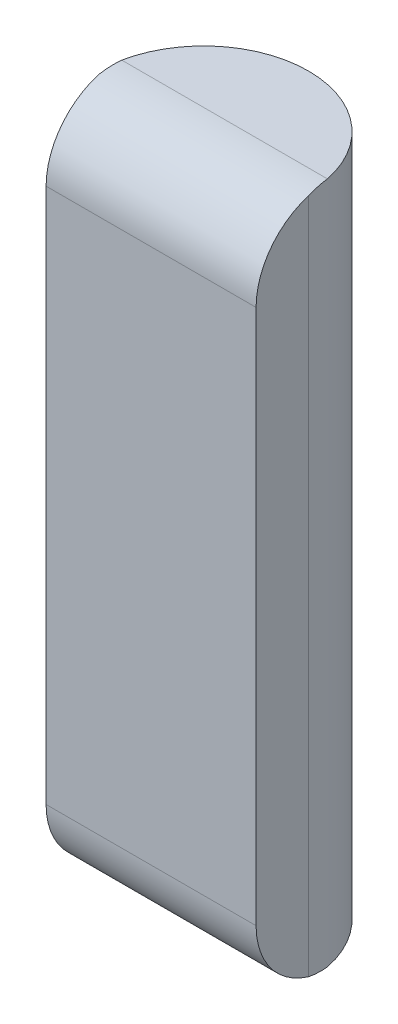
ISO-10303-21;
HEADER;
FILE_DESCRIPTION(('STEP AP214'),'2;1');
FILE_NAME('part.step','',(''),(''),'','','');
FILE_SCHEMA(('AUTOMOTIVE_DESIGN { 1 0 10303 214 1 1 1 1 }'));
ENDSEC;
DATA;
#1=APPLICATION_CONTEXT('core data for automotive mechanical design processes');
#2=APPLICATION_PROTOCOL_DEFINITION('international standard','automotive_design',2000,#1);
#3=PRODUCT_CONTEXT('',#1,'mechanical');
#4=PRODUCT('Part','Part','',(#3));
#5=PRODUCT_RELATED_PRODUCT_CATEGORY('part','',(#4));
#6=PRODUCT_DEFINITION_FORMATION('','',#4);
#7=PRODUCT_DEFINITION_CONTEXT('part definition',#1,'design');
#8=PRODUCT_DEFINITION('design','',#6,#7);
#9=PRODUCT_DEFINITION_SHAPE('','',#8);
#10=(LENGTH_UNIT() NAMED_UNIT(*) SI_UNIT(.MILLI.,.METRE.));
#11=(NAMED_UNIT(*) PLANE_ANGLE_UNIT() SI_UNIT($,.RADIAN.));
#12=(NAMED_UNIT(*) SI_UNIT($,.STERADIAN.) SOLID_ANGLE_UNIT());
#13=UNCERTAINTY_MEASURE_WITH_UNIT(LENGTH_MEASURE(1.E-05),#10,'distance_accuracy_value','');
#14=(GEOMETRIC_REPRESENTATION_CONTEXT(3) GLOBAL_UNCERTAINTY_ASSIGNED_CONTEXT((#13)) GLOBAL_UNIT_ASSIGNED_CONTEXT((#10,
#11,#12)) REPRESENTATION_CONTEXT('',''));
#15=CARTESIAN_POINT('',(0.,0.,0.));
#16=DIRECTION('',(0.,0.,1.));
#17=DIRECTION('',(1.,0.,0.));
#18=AXIS2_PLACEMENT_3D('',#15,#16,#17);
#19=CARTESIAN_POINT('',(-0.2,0.,0.35));
#20=DIRECTION('',(0.,1.,0.));
#21=DIRECTION('',(0.,0.,-1.));
#22=AXIS2_PLACEMENT_3D('',#19,#20,#21);
#23=CYLINDRICAL_SURFACE('',#22,0.1);
#24=CARTESIAN_POINT('',(-0.0999999999999996,0.647082039324995,0.349999999999997));
#25=CARTESIAN_POINT('',(-0.100084183762028,0.647323506050398,0.349190121189793));
#26=CARTESIAN_POINT('',(-0.100168367524056,0.647550292569989,0.348375866058584));
#27=CARTESIAN_POINT('',(-0.100336735048112,0.647974238368766,0.34673967912913));
#28=CARTESIAN_POINT('',(-0.10042091881014,0.648171397647952,0.345917747330885));
#29=CARTESIAN_POINT('',(-0.100589286334196,0.648535822137135,0.344267283042332));
#30=CARTESIAN_POINT('',(-0.100673470096224,0.648703087347132,0.343438750552023));
#31=CARTESIAN_POINT('',(-0.10084183762028,0.649007506544538,0.341776172212152));
#32=CARTESIAN_POINT('',(-0.100926021382308,0.649144660531946,0.340942126362589));
#33=CARTESIAN_POINT('',(-0.101094388906364,0.649388676630988,0.339269615138349));
#34=CARTESIAN_POINT('',(-0.101178572668392,0.649495538742622,0.338431149763672));
#35=CARTESIAN_POINT('',(-0.101346940192448,0.649678831688704,0.336750899341898));
#36=CARTESIAN_POINT('',(-0.101431123954476,0.649755262523153,0.3359091142948));
#37=CARTESIAN_POINT('',(-0.101599491478532,0.649877590349677,0.334223328579187));
#38=CARTESIAN_POINT('',(-0.10168367524056,0.649923487341753,0.333379327910672));
#39=CARTESIAN_POINT('',(-0.101852042764616,0.649984695768093,0.331690218311812));
#40=CARTESIAN_POINT('',(-0.101936226526644,0.650000007202358,0.330845109381467));
#41=CARTESIAN_POINT('',(-0.102020410288672,0.65,0.33));
#42=B_SPLINE_CURVE_WITH_KNOTS('',3,(#24,#25,#26,#27,#28,#29,#30,#31,#32,#33,#34,#35,#36,#37,#38,
#39,#40,#41),.UNSPECIFIED.,.F.,.F.,(4,2,2,2,2,2,2,2,4),(0.,0.00254773712594254,
0.00509547425188514,0.00764321137782773,0.0101909485037703,0.0127386856297129,
0.0152864227556554,0.017834159881598,0.0203818970075406),.UNSPECIFIED.);
#43=CARTESIAN_POINT('',(-0.0999999999999996,0.647082039324994,0.35));
#44=VERTEX_POINT('',#43);
#45=CARTESIAN_POINT('',(-0.102020410288672,0.65,0.33));
#46=VERTEX_POINT('',#45);
#47=EDGE_CURVE('E11',#44,#46,#42,.T.);
#48=ORIENTED_EDGE('',*,*,#47,.F.);
#49=DIRECTION('',(0.,1.,0.));
#50=VECTOR('',#49,1.);
#51=CARTESIAN_POINT('',(-0.0999999999999996,0.,0.35));
#52=LINE('',#51,#50);
#53=CARTESIAN_POINT('',(-0.0999999999999996,0.00291796067500623,0.35));
#54=VERTEX_POINT('',#53);
#55=EDGE_CURVE('E25',#54,#44,#52,.T.);
#56=ORIENTED_EDGE('',*,*,#55,.F.);
#57=CARTESIAN_POINT('',(-0.102020410288672,0.,0.33));
#58=CARTESIAN_POINT('',(-0.101936226526644,-7.20235841984537E-09,0.330845109381467));
#59=CARTESIAN_POINT('',(-0.101852042764616,1.53042319068143E-05,0.331690218311812));
#60=CARTESIAN_POINT('',(-0.10168367524056,7.65126582474996E-05,0.333379327910672));
#61=CARTESIAN_POINT('',(-0.101599491478532,0.000122409650322952,0.334223328579187));
#62=CARTESIAN_POINT('',(-0.101431123954476,0.000244737476846982,0.3359091142948));
#63=CARTESIAN_POINT('',(-0.101346940192448,0.000321168311295557,0.336750899341898));
#64=CARTESIAN_POINT('',(-0.101178572668392,0.00050446125737801,0.338431149763672));
#65=CARTESIAN_POINT('',(-0.101094388906364,0.000611323369011887,0.339269615138349));
#66=CARTESIAN_POINT('',(-0.100926021382308,0.000855339468053773,0.340942126362589));
#67=CARTESIAN_POINT('',(-0.10084183762028,0.000992493455461783,0.341776172212152));
#68=CARTESIAN_POINT('',(-0.100673470096224,0.00129691265286741,0.343438750552023));
#69=CARTESIAN_POINT('',(-0.100589286334196,0.00146417786286502,0.344267283042332));
#70=CARTESIAN_POINT('',(-0.10042091881014,0.00182860235204825,0.345917747330885));
#71=CARTESIAN_POINT('',(-0.100336735048112,0.00202576163123387,0.34673967912913));
#72=CARTESIAN_POINT('',(-0.100168367524056,0.00244970743001086,0.348375866058584));
#73=CARTESIAN_POINT('',(-0.100084183762028,0.00267649394960224,0.349190121189793));
#74=CARTESIAN_POINT('',(-0.0999999999999997,0.00291796067500538,0.349999999999997));
#75=B_SPLINE_CURVE_WITH_KNOTS('',3,(#57,#58,#59,#60,#61,#62,#63,#64,#65,#66,#67,#68,#69,#70,#71,
#72,#73,#74),.UNSPECIFIED.,.F.,.F.,(4,2,2,2,2,2,2,2,4),(0.,0.00254773712594254,
0.00509547425188523,0.00764321137782783,0.0101909485037704,0.012738685629713,0.0152864227556556,
0.0178341598815981,0.0203818970075408),.UNSPECIFIED.);
#76=CARTESIAN_POINT('',(-0.102020410288672,0.,0.33));
#77=VERTEX_POINT('',#76);
#78=EDGE_CURVE('E171',#77,#54,#75,.T.);
#79=ORIENTED_EDGE('',*,*,#78,.F.);
#80=CARTESIAN_POINT('',(-0.2,0.,0.35));
#81=DIRECTION('',(0.,1.,0.));
#82=DIRECTION('',(0.,0.,1.));
#83=AXIS2_PLACEMENT_3D('',#80,#81,#82);
#84=CIRCLE('',#83,0.1);
#85=CARTESIAN_POINT('',(-0.297979589711327,0.,0.33));
#86=VERTEX_POINT('',#85);
#87=EDGE_CURVE('E206',#77,#86,#84,.T.);
#88=ORIENTED_EDGE('',*,*,#87,.T.);
#89=CARTESIAN_POINT('',(-0.3,0.00291796067500535,0.349999999999997));
#90=CARTESIAN_POINT('',(-0.299915816237971,0.0026764939496022,0.349190121189793));
#91=CARTESIAN_POINT('',(-0.299831632475942,0.00244970743001083,0.348375866058584));
#92=CARTESIAN_POINT('',(-0.299663264951883,0.00202576163123386,0.34673967912913));
#93=CARTESIAN_POINT('',(-0.299579081189854,0.00182860235204825,0.345917747330885));
#94=CARTESIAN_POINT('',(-0.299410713665796,0.00146417786286502,0.344267283042332));
#95=CARTESIAN_POINT('',(-0.299326529903767,0.0012969126528674,0.343438750552023));
#96=CARTESIAN_POINT('',(-0.299158162379708,0.00099249345546176,0.341776172212152));
#97=CARTESIAN_POINT('',(-0.299073978617679,0.000855339468053745,0.340942126362589));
#98=CARTESIAN_POINT('',(-0.298905611093621,0.000611323369011869,0.339269615138349));
#99=CARTESIAN_POINT('',(-0.298821427331592,0.000504461257378004,0.338431149763672));
#100=CARTESIAN_POINT('',(-0.298653059807533,0.000321168311295559,0.336750899341898));
#101=CARTESIAN_POINT('',(-0.298568876045504,0.00024473747684698,0.3359091142948));
#102=CARTESIAN_POINT('',(-0.298400508521446,0.000122409650322956,0.334223328579187));
#103=CARTESIAN_POINT('',(-0.298316324759417,7.65126582475103E-05,0.333379327910672));
#104=CARTESIAN_POINT('',(-0.298147957235358,1.53042319068288E-05,0.331690218311812));
#105=CARTESIAN_POINT('',(-0.298063773473329,-7.20235840708838E-09,0.330845109381467));
#106=CARTESIAN_POINT('',(-0.2979795897113,0.,0.33));
#107=B_SPLINE_CURVE_WITH_KNOTS('',3,(#89,#90,#91,#92,#93,#94,#95,#96,#97,#98,#99,#100,#101,#102,
#103,#104,#105,#106),.UNSPECIFIED.,.F.,.F.,(4,2,2,2,2,2,2,2,4),(0.,0.00254773712594293,
0.00509547425188588,0.00764321137782877,0.0101909485037718,0.0127386856297146,
0.0152864227556575,0.0178341598816005,0.0203818970075434),.UNSPECIFIED.);
#108=CARTESIAN_POINT('',(-0.3,0.00291796067500618,0.35));
#109=VERTEX_POINT('',#108);
#110=EDGE_CURVE('E203',#109,#86,#107,.T.);
#111=ORIENTED_EDGE('',*,*,#110,.F.);
#112=DIRECTION('',(0.,1.,0.));
#113=VECTOR('',#112,1.);
#114=CARTESIAN_POINT('',(-0.3,0.,0.35));
#115=LINE('',#114,#113);
#116=CARTESIAN_POINT('',(-0.3,0.647082039324994,0.35));
#117=VERTEX_POINT('',#116);
#118=EDGE_CURVE('E75',#109,#117,#115,.T.);
#119=ORIENTED_EDGE('',*,*,#118,.T.);
#120=CARTESIAN_POINT('',(-0.297979589711327,0.65,0.33));
#121=CARTESIAN_POINT('',(-0.298063773473355,0.650000007202358,0.330845109381467));
#122=CARTESIAN_POINT('',(-0.298147957235383,0.649984695768093,0.331690218311812));
#123=CARTESIAN_POINT('',(-0.298316324759439,0.649923487341753,0.333379327910672));
#124=CARTESIAN_POINT('',(-0.298400508521467,0.649877590349677,0.334223328579187));
#125=CARTESIAN_POINT('',(-0.298568876045523,0.649755262523153,0.3359091142948));
#126=CARTESIAN_POINT('',(-0.298653059807551,0.649678831688704,0.336750899341897));
#127=CARTESIAN_POINT('',(-0.298821427331607,0.649495538742622,0.338431149763672));
#128=CARTESIAN_POINT('',(-0.298905611093635,0.649388676630988,0.339269615138349));
#129=CARTESIAN_POINT('',(-0.299073978617692,0.649144660531946,0.340942126362589));
#130=CARTESIAN_POINT('',(-0.29915816237972,0.649007506544538,0.341776172212152));
#131=CARTESIAN_POINT('',(-0.299326529903776,0.648703087347132,0.343438750552023));
#132=CARTESIAN_POINT('',(-0.299410713665804,0.648535822137135,0.344267283042332));
#133=CARTESIAN_POINT('',(-0.29957908118986,0.648171397647952,0.345917747330885));
#134=CARTESIAN_POINT('',(-0.299663264951888,0.647974238368766,0.34673967912913));
#135=CARTESIAN_POINT('',(-0.299831632475944,0.647550292569989,0.348375866058584));
#136=CARTESIAN_POINT('',(-0.299915816237972,0.647323506050398,0.349190121189793));
#137=CARTESIAN_POINT('',(-0.3,0.647082039324995,0.349999999999997));
#138=B_SPLINE_CURVE_WITH_KNOTS('',3,(#120,#121,#122,#123,#124,#125,#126,#127,#128,#129,#130,
#131,#132,#133,#134,#135,#136,#137),.UNSPECIFIED.,.F.,.F.,(4,2,2,2,2,2,2,2,4),(0.,
0.00254773712594256,0.00509547425188514,0.00764321137782775,0.0101909485037703,
0.0127386856297129,0.0152864227556555,0.0178341598815981,0.0203818970075407),.UNSPECIFIED.);
#139=CARTESIAN_POINT('',(-0.297979589711327,0.65,0.33));
#140=VERTEX_POINT('',#139);
#141=EDGE_CURVE('E125',#140,#117,#138,.T.);
#142=ORIENTED_EDGE('',*,*,#141,.F.);
#143=CARTESIAN_POINT('',(-0.2,0.65,0.35));
#144=DIRECTION('',(0.,1.,0.));
#145=DIRECTION('',(0.,0.,1.));
#146=AXIS2_PLACEMENT_3D('',#143,#144,#145);
#147=CIRCLE('',#146,0.1);
#148=EDGE_CURVE('E120',#46,#140,#147,.T.);
#149=ORIENTED_EDGE('',*,*,#148,.F.);
#150=EDGE_LOOP('',(#48,#56,#79,#88,#111,#119,#142,#149));
#151=FACE_BOUND('',#150,.T.);
#152=ADVANCED_FACE('F17',(#151),#23,.T.);
#153=CARTESIAN_POINT('',(-0.0999999999999996,0.,0.35));
#154=DIRECTION('',(1.,0.,0.));
#155=DIRECTION('',(0.,0.,-1.));
#156=AXIS2_PLACEMENT_3D('',#153,#154,#155);
#157=PLANE('',#156);
#158=CARTESIAN_POINT('',(-0.0999999999999995,0.58,0.33));
#159=DIRECTION('',(-1.,0.,0.));
#160=DIRECTION('',(0.,0.,-1.));
#161=AXIS2_PLACEMENT_3D('',#158,#159,#160);
#162=CIRCLE('',#161,0.07);
#163=CARTESIAN_POINT('',(-0.0999999999999992,0.58,0.4));
#164=VERTEX_POINT('',#163);
#165=EDGE_CURVE('E116',#164,#44,#162,.T.);
#166=ORIENTED_EDGE('',*,*,#165,.F.);
#167=DIRECTION('',(0.,-1.,0.));
#168=VECTOR('',#167,1.);
#169=CARTESIAN_POINT('',(-0.0999999999999998,0.65,0.4));
#170=LINE('',#169,#168);
#171=CARTESIAN_POINT('',(-0.0999999999999992,0.07,0.4));
#172=VERTEX_POINT('',#171);
#173=EDGE_CURVE('E114',#164,#172,#170,.T.);
#174=ORIENTED_EDGE('',*,*,#173,.T.);
#175=CARTESIAN_POINT('',(-0.0999999999999995,0.07,0.33));
#176=DIRECTION('',(-1.,0.,0.));
#177=DIRECTION('',(0.,0.,-1.));
#178=AXIS2_PLACEMENT_3D('',#175,#176,#177);
#179=CIRCLE('',#178,0.07);
#180=EDGE_CURVE('E94',#54,#172,#179,.T.);
#181=ORIENTED_EDGE('',*,*,#180,.F.);
#182=ORIENTED_EDGE('',*,*,#55,.T.);
#183=EDGE_LOOP('',(#166,#174,#181,#182));
#184=FACE_BOUND('',#183,.T.);
#185=ADVANCED_FACE('F226',(#184),#157,.T.);
#186=CARTESIAN_POINT('',(-0.3,0.,0.4));
#187=DIRECTION('',(-1.,0.,0.));
#188=DIRECTION('',(0.,0.,1.));
#189=AXIS2_PLACEMENT_3D('',#186,#187,#188);
#190=PLANE('',#189);
#191=CARTESIAN_POINT('',(-0.3,0.58,0.33));
#192=DIRECTION('',(1.,0.,0.));
#193=DIRECTION('',(0.,0.,1.));
#194=AXIS2_PLACEMENT_3D('',#191,#192,#193);
#195=CIRCLE('',#194,0.07);
#196=CARTESIAN_POINT('',(-0.3,0.58,0.4));
#197=VERTEX_POINT('',#196);
#198=EDGE_CURVE('E79',#117,#197,#195,.T.);
#199=ORIENTED_EDGE('',*,*,#198,.F.);
#200=ORIENTED_EDGE('',*,*,#118,.F.);
#201=CARTESIAN_POINT('',(-0.3,0.07,0.33));
#202=DIRECTION('',(1.,0.,0.));
#203=DIRECTION('',(0.,0.,1.));
#204=AXIS2_PLACEMENT_3D('',#201,#202,#203);
#205=CIRCLE('',#204,0.07);
#206=CARTESIAN_POINT('',(-0.3,0.07,0.4));
#207=VERTEX_POINT('',#206);
#208=EDGE_CURVE('E69',#207,#109,#205,.T.);
#209=ORIENTED_EDGE('',*,*,#208,.F.);
#210=DIRECTION('',(0.,1.,0.));
#211=VECTOR('',#210,1.);
#212=CARTESIAN_POINT('',(-0.3,0.,0.4));
#213=LINE('',#212,#211);
#214=EDGE_CURVE('E73',#207,#197,#213,.T.);
#215=ORIENTED_EDGE('',*,*,#214,.T.);
#216=EDGE_LOOP('',(#199,#200,#209,#215));
#217=FACE_BOUND('',#216,.T.);
#218=ADVANCED_FACE('F72',(#217),#190,.T.);
#219=CARTESIAN_POINT('',(0.,0.58,0.33));
#220=DIRECTION('',(-1.,0.,0.));
#221=DIRECTION('',(0.,0.,1.));
#222=AXIS2_PLACEMENT_3D('',#219,#220,#221);
#223=CYLINDRICAL_SURFACE('',#222,0.07);
#224=DIRECTION('',(1.,0.,0.));
#225=VECTOR('',#224,1.);
#226=CARTESIAN_POINT('',(0.8,0.65,0.33));
#227=LINE('',#226,#225);
#228=EDGE_CURVE('E88',#140,#46,#227,.T.);
#229=ORIENTED_EDGE('',*,*,#228,.F.);
#230=ORIENTED_EDGE('',*,*,#141,.T.);
#231=ORIENTED_EDGE('',*,*,#198,.T.);
#232=DIRECTION('',(-1.,0.,0.));
#233=VECTOR('',#232,1.);
#234=CARTESIAN_POINT('',(-0.8,0.58,0.4));
#235=LINE('',#234,#233);
#236=EDGE_CURVE('E87',#164,#197,#235,.T.);
#237=ORIENTED_EDGE('',*,*,#236,.F.);
#238=ORIENTED_EDGE('',*,*,#165,.T.);
#239=ORIENTED_EDGE('',*,*,#47,.T.);
#240=EDGE_LOOP('',(#229,#230,#231,#237,#238,#239));
#241=FACE_BOUND('',#240,.T.);
#242=ADVANCED_FACE('F141',(#241),#223,.T.);
#243=CARTESIAN_POINT('',(0.,0.65,0.));
#244=DIRECTION('',(0.,1.,0.));
#245=DIRECTION('',(0.,0.,1.));
#246=AXIS2_PLACEMENT_3D('',#243,#244,#245);
#247=PLANE('',#246);
#248=ORIENTED_EDGE('',*,*,#228,.T.);
#249=ORIENTED_EDGE('',*,*,#148,.T.);
#250=EDGE_LOOP('',(#248,#249));
#251=FACE_BOUND('',#250,.T.);
#252=ADVANCED_FACE('F151',(#251),#247,.T.);
#253=CARTESIAN_POINT('',(0.8,0.65,0.4));
#254=DIRECTION('',(0.,0.,-1.));
#255=DIRECTION('',(-1.,0.,0.));
#256=AXIS2_PLACEMENT_3D('',#253,#254,#255);
#257=PLANE('',#256);
#258=ORIENTED_EDGE('',*,*,#214,.F.);
#259=DIRECTION('',(1.,0.,0.));
#260=VECTOR('',#259,1.);
#261=CARTESIAN_POINT('',(0.8,0.07,0.4));
#262=LINE('',#261,#260);
#263=EDGE_CURVE('E85',#207,#172,#262,.T.);
#264=ORIENTED_EDGE('',*,*,#263,.T.);
#265=ORIENTED_EDGE('',*,*,#173,.F.);
#266=ORIENTED_EDGE('',*,*,#236,.T.);
#267=EDGE_LOOP('',(#258,#264,#265,#266));
#268=FACE_BOUND('',#267,.T.);
#269=ADVANCED_FACE('F83',(#268),#257,.F.);
#270=CARTESIAN_POINT('',(0.8,0.07,0.33));
#271=DIRECTION('',(1.,0.,0.));
#272=DIRECTION('',(0.,0.,-1.));
#273=AXIS2_PLACEMENT_3D('',#270,#271,#272);
#274=CYLINDRICAL_SURFACE('',#273,0.07);
#275=ORIENTED_EDGE('',*,*,#208,.T.);
#276=ORIENTED_EDGE('',*,*,#110,.T.);
#277=DIRECTION('',(-1.,0.,0.));
#278=VECTOR('',#277,1.);
#279=CARTESIAN_POINT('',(0.,0.,0.33));
#280=LINE('',#279,#278);
#281=EDGE_CURVE('E95',#77,#86,#280,.T.);
#282=ORIENTED_EDGE('',*,*,#281,.F.);
#283=ORIENTED_EDGE('',*,*,#78,.T.);
#284=ORIENTED_EDGE('',*,*,#180,.T.);
#285=ORIENTED_EDGE('',*,*,#263,.F.);
#286=EDGE_LOOP('',(#275,#276,#282,#283,#284,#285));
#287=FACE_BOUND('',#286,.T.);
#288=ADVANCED_FACE('F91',(#287),#274,.T.);
#289=CARTESIAN_POINT('',(0.,0.,0.));
#290=DIRECTION('',(0.,1.,0.));
#291=DIRECTION('',(0.,0.,1.));
#292=AXIS2_PLACEMENT_3D('',#289,#290,#291);
#293=PLANE('',#292);
#294=ORIENTED_EDGE('',*,*,#87,.F.);
#295=ORIENTED_EDGE('',*,*,#281,.T.);
#296=EDGE_LOOP('',(#294,#295));
#297=FACE_BOUND('',#296,.T.);
#298=ADVANCED_FACE('F189',(#297),#293,.F.);
#299=CLOSED_SHELL('',(#152,#185,#218,#242,#252,#269,#288,#298));
#300=MANIFOLD_SOLID_BREP('B1',#299);
#301=ADVANCED_BREP_SHAPE_REPRESENTATION('',(#18,#300),#14);
#302=SHAPE_DEFINITION_REPRESENTATION(#9,#301);
ENDSEC;
END-ISO-10303-21;
